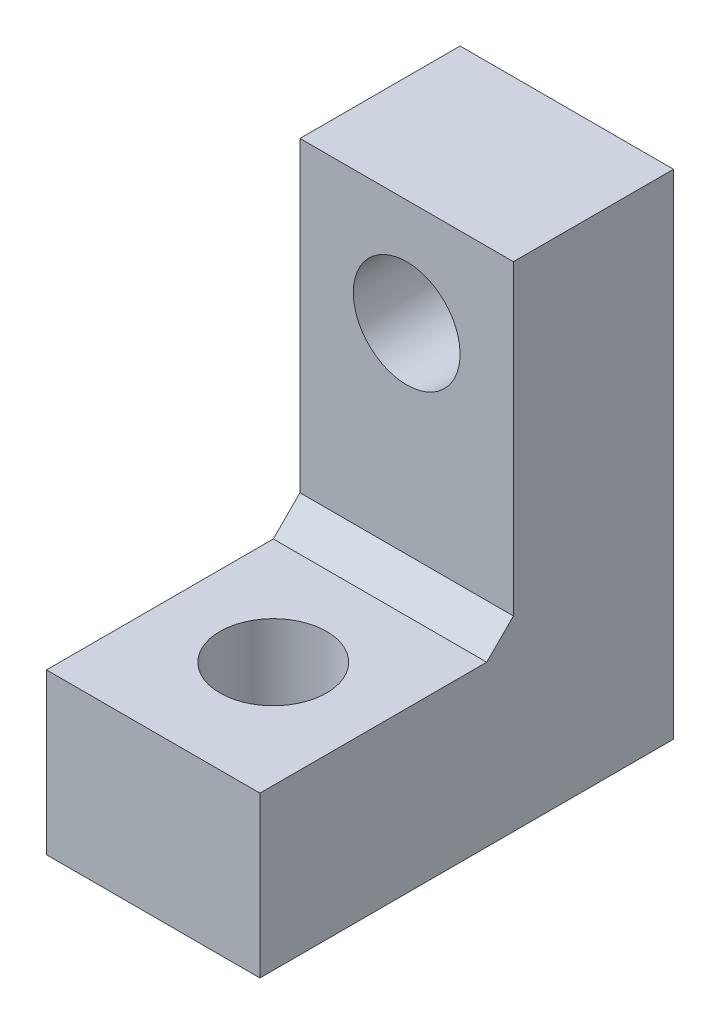
ISO-10303-21;
HEADER;
FILE_DESCRIPTION(('STEP AP214'),'2;1');
FILE_NAME('part.step','',(''),(''),'','','');
FILE_SCHEMA(('AUTOMOTIVE_DESIGN { 1 0 10303 214 1 1 1 1 }'));
ENDSEC;
DATA;
#1=APPLICATION_CONTEXT('core data for automotive mechanical design processes');
#2=APPLICATION_PROTOCOL_DEFINITION('international standard','automotive_design',2000,#1);
#3=PRODUCT_CONTEXT('',#1,'mechanical');
#4=PRODUCT('Part','Part','',(#3));
#5=PRODUCT_RELATED_PRODUCT_CATEGORY('part','',(#4));
#6=PRODUCT_DEFINITION_FORMATION('','',#4);
#7=PRODUCT_DEFINITION_CONTEXT('part definition',#1,'design');
#8=PRODUCT_DEFINITION('design','',#6,#7);
#9=PRODUCT_DEFINITION_SHAPE('','',#8);
#10=(LENGTH_UNIT() NAMED_UNIT(*) SI_UNIT(.MILLI.,.METRE.));
#11=(NAMED_UNIT(*) PLANE_ANGLE_UNIT() SI_UNIT($,.RADIAN.));
#12=(NAMED_UNIT(*) SI_UNIT($,.STERADIAN.) SOLID_ANGLE_UNIT());
#13=UNCERTAINTY_MEASURE_WITH_UNIT(LENGTH_MEASURE(1.E-05),#10,'distance_accuracy_value','');
#14=(GEOMETRIC_REPRESENTATION_CONTEXT(3) GLOBAL_UNCERTAINTY_ASSIGNED_CONTEXT((#13)) GLOBAL_UNIT_ASSIGNED_CONTEXT((#10,
#11,#12)) REPRESENTATION_CONTEXT('',''));
#15=CARTESIAN_POINT('',(0.,0.,0.));
#16=DIRECTION('',(0.,0.,1.));
#17=DIRECTION('',(1.,0.,0.));
#18=AXIS2_PLACEMENT_3D('',#15,#16,#17);
#19=CARTESIAN_POINT('',(8.,0.,-9.5));
#20=DIRECTION('',(0.,0.,1.));
#21=DIRECTION('',(0.,-1.,0.));
#22=AXIS2_PLACEMENT_3D('',#19,#20,#21);
#23=PLANE('',#22);
#24=CARTESIAN_POINT('',(4.,14.5,-9.5));
#25=DIRECTION('',(0.,0.,1.));
#26=DIRECTION('',(0.,-1.,0.));
#27=AXIS2_PLACEMENT_3D('',#24,#25,#26);
#28=CIRCLE('',#27,2.);
#29=CARTESIAN_POINT('',(4.,12.5,-9.5));
#30=VERTEX_POINT('',#29);
#31=EDGE_CURVE('E127',#30,#30,#28,.F.);
#32=ORIENTED_EDGE('',*,*,#31,.T.);
#33=EDGE_LOOP('',(#32));
#34=FACE_BOUND('',#33,.T.);
#35=DIRECTION('',(0.,1.,0.));
#36=VECTOR('',#35,1.);
#37=CARTESIAN_POINT('',(0.,0.,-9.5));
#38=LINE('',#37,#36);
#39=CARTESIAN_POINT('',(0.,7.,-9.5));
#40=VERTEX_POINT('',#39);
#41=CARTESIAN_POINT('',(0.,18.5,-9.5));
#42=VERTEX_POINT('',#41);
#43=EDGE_CURVE('E125',#40,#42,#38,.T.);
#44=ORIENTED_EDGE('',*,*,#43,.F.);
#45=DIRECTION('',(1.,0.,0.));
#46=VECTOR('',#45,1.);
#47=CARTESIAN_POINT('',(8.,7.,-9.5));
#48=LINE('',#47,#46);
#49=CARTESIAN_POINT('',(8.,7.,-9.5));
#50=VERTEX_POINT('',#49);
#51=EDGE_CURVE('E49',#40,#50,#48,.T.);
#52=ORIENTED_EDGE('',*,*,#51,.T.);
#53=DIRECTION('',(0.,1.,0.));
#54=VECTOR('',#53,1.);
#55=CARTESIAN_POINT('',(8.,0.,-9.5));
#56=LINE('',#55,#54);
#57=CARTESIAN_POINT('',(8.,18.5,-9.5));
#58=VERTEX_POINT('',#57);
#59=EDGE_CURVE('E110',#50,#58,#56,.T.);
#60=ORIENTED_EDGE('',*,*,#59,.T.);
#61=DIRECTION('',(-1.,0.,0.));
#62=VECTOR('',#61,1.);
#63=CARTESIAN_POINT('',(8.,18.5,-9.5));
#64=LINE('',#63,#62);
#65=EDGE_CURVE('E124',#58,#42,#64,.T.);
#66=ORIENTED_EDGE('',*,*,#65,.T.);
#67=EDGE_LOOP('',(#44,#52,#60,#66));
#68=FACE_BOUND('',#67,.T.);
#69=ADVANCED_FACE('F34',(#34,#68),#23,.T.);
#70=CARTESIAN_POINT('',(8.,6.,0.));
#71=DIRECTION('',(0.,1.,0.));
#72=DIRECTION('',(0.,0.,1.));
#73=AXIS2_PLACEMENT_3D('',#70,#71,#72);
#74=PLANE('',#73);
#75=CARTESIAN_POINT('',(4.,6.,-4.5));
#76=DIRECTION('',(0.,1.,0.));
#77=DIRECTION('',(0.,0.,1.));
#78=AXIS2_PLACEMENT_3D('',#75,#76,#77);
#79=CIRCLE('',#78,2.);
#80=CARTESIAN_POINT('',(4.,6.,-2.5));
#81=VERTEX_POINT('',#80);
#82=EDGE_CURVE('E177',#81,#81,#79,.T.);
#83=ORIENTED_EDGE('',*,*,#82,.F.);
#84=EDGE_LOOP('',(#83));
#85=FACE_BOUND('',#84,.T.);
#86=DIRECTION('',(0.,0.,-1.));
#87=VECTOR('',#86,1.);
#88=CARTESIAN_POINT('',(8.,6.,0.));
#89=LINE('',#88,#87);
#90=CARTESIAN_POINT('',(8.,6.,0.));
#91=VERTEX_POINT('',#90);
#92=CARTESIAN_POINT('',(8.,6.,-8.49999999999999));
#93=VERTEX_POINT('',#92);
#94=EDGE_CURVE('E95',#91,#93,#89,.T.);
#95=ORIENTED_EDGE('',*,*,#94,.T.);
#96=DIRECTION('',(-1.,0.,0.));
#97=VECTOR('',#96,1.);
#98=CARTESIAN_POINT('',(0.,6.,-8.49999999999999));
#99=LINE('',#98,#97);
#100=CARTESIAN_POINT('',(0.,6.,-8.49999999999999));
#101=VERTEX_POINT('',#100);
#102=EDGE_CURVE('E102',#93,#101,#99,.T.);
#103=ORIENTED_EDGE('',*,*,#102,.T.);
#104=DIRECTION('',(0.,0.,-1.));
#105=VECTOR('',#104,1.);
#106=CARTESIAN_POINT('',(0.,6.,0.));
#107=LINE('',#106,#105);
#108=CARTESIAN_POINT('',(0.,6.,0.));
#109=VERTEX_POINT('',#108);
#110=EDGE_CURVE('E97',#109,#101,#107,.T.);
#111=ORIENTED_EDGE('',*,*,#110,.F.);
#112=DIRECTION('',(-1.,0.,0.));
#113=VECTOR('',#112,1.);
#114=CARTESIAN_POINT('',(8.,6.,0.));
#115=LINE('',#114,#113);
#116=EDGE_CURVE('E91',#91,#109,#115,.T.);
#117=ORIENTED_EDGE('',*,*,#116,.F.);
#118=EDGE_LOOP('',(#95,#103,#111,#117));
#119=FACE_BOUND('',#118,.T.);
#120=ADVANCED_FACE('F93',(#85,#119),#74,.T.);
#121=CARTESIAN_POINT('',(8.,0.,0.));
#122=DIRECTION('',(0.,0.,1.));
#123=DIRECTION('',(1.,0.,0.));
#124=AXIS2_PLACEMENT_3D('',#121,#122,#123);
#125=PLANE('',#124);
#126=DIRECTION('',(0.,1.,0.));
#127=VECTOR('',#126,1.);
#128=CARTESIAN_POINT('',(0.,0.,0.));
#129=LINE('',#128,#127);
#130=CARTESIAN_POINT('',(0.,0.,0.));
#131=VERTEX_POINT('',#130);
#132=EDGE_CURVE('E129',#131,#109,#129,.T.);
#133=ORIENTED_EDGE('',*,*,#132,.F.);
#134=DIRECTION('',(-1.,0.,0.));
#135=VECTOR('',#134,1.);
#136=CARTESIAN_POINT('',(8.,0.,0.));
#137=LINE('',#136,#135);
#138=CARTESIAN_POINT('',(8.,0.,0.));
#139=VERTEX_POINT('',#138);
#140=EDGE_CURVE('E103',#139,#131,#137,.T.);
#141=ORIENTED_EDGE('',*,*,#140,.F.);
#142=DIRECTION('',(0.,1.,0.));
#143=VECTOR('',#142,1.);
#144=CARTESIAN_POINT('',(8.,0.,0.));
#145=LINE('',#144,#143);
#146=EDGE_CURVE('E108',#139,#91,#145,.T.);
#147=ORIENTED_EDGE('',*,*,#146,.T.);
#148=ORIENTED_EDGE('',*,*,#116,.T.);
#149=EDGE_LOOP('',(#133,#141,#147,#148));
#150=FACE_BOUND('',#149,.T.);
#151=ADVANCED_FACE('F112',(#150),#125,.T.);
#152=CARTESIAN_POINT('',(8.,0.,0.));
#153=DIRECTION('',(0.,1.,0.));
#154=DIRECTION('',(0.,0.,1.));
#155=AXIS2_PLACEMENT_3D('',#152,#153,#154);
#156=PLANE('',#155);
#157=CARTESIAN_POINT('',(4.,0.,-4.5));
#158=DIRECTION('',(0.,1.,0.));
#159=DIRECTION('',(0.,0.,1.));
#160=AXIS2_PLACEMENT_3D('',#157,#158,#159);
#161=CIRCLE('',#160,2.);
#162=CARTESIAN_POINT('',(4.,0.,-2.5));
#163=VERTEX_POINT('',#162);
#164=EDGE_CURVE('E172',#163,#163,#161,.T.);
#165=ORIENTED_EDGE('',*,*,#164,.T.);
#166=EDGE_LOOP('',(#165));
#167=FACE_BOUND('',#166,.T.);
#168=DIRECTION('',(0.,0.,-1.));
#169=VECTOR('',#168,1.);
#170=CARTESIAN_POINT('',(0.,0.,0.));
#171=LINE('',#170,#169);
#172=CARTESIAN_POINT('',(0.,0.,-15.5));
#173=VERTEX_POINT('',#172);
#174=EDGE_CURVE('E131',#131,#173,#171,.T.);
#175=ORIENTED_EDGE('',*,*,#174,.T.);
#176=DIRECTION('',(-1.,0.,0.));
#177=VECTOR('',#176,1.);
#178=CARTESIAN_POINT('',(8.,0.,-15.5));
#179=LINE('',#178,#177);
#180=CARTESIAN_POINT('',(8.,0.,-15.5));
#181=VERTEX_POINT('',#180);
#182=EDGE_CURVE('E143',#181,#173,#179,.T.);
#183=ORIENTED_EDGE('',*,*,#182,.F.);
#184=DIRECTION('',(0.,0.,-1.));
#185=VECTOR('',#184,1.);
#186=CARTESIAN_POINT('',(8.,0.,0.));
#187=LINE('',#186,#185);
#188=EDGE_CURVE('E114',#139,#181,#187,.T.);
#189=ORIENTED_EDGE('',*,*,#188,.F.);
#190=ORIENTED_EDGE('',*,*,#140,.T.);
#191=EDGE_LOOP('',(#175,#183,#189,#190));
#192=FACE_BOUND('',#191,.T.);
#193=ADVANCED_FACE('F155',(#167,#192),#156,.F.);
#194=CARTESIAN_POINT('',(8.,0.,-15.5));
#195=DIRECTION('',(0.,0.,1.));
#196=DIRECTION('',(1.,0.,0.));
#197=AXIS2_PLACEMENT_3D('',#194,#195,#196);
#198=PLANE('',#197);
#199=CARTESIAN_POINT('',(4.,14.5,-15.5));
#200=DIRECTION('',(0.,0.,-1.));
#201=DIRECTION('',(-1.,0.,0.));
#202=AXIS2_PLACEMENT_3D('',#199,#200,#201);
#203=CIRCLE('',#202,2.);
#204=CARTESIAN_POINT('',(2.,14.5,-15.5));
#205=VERTEX_POINT('',#204);
#206=EDGE_CURVE('E168',#205,#205,#203,.T.);
#207=ORIENTED_EDGE('',*,*,#206,.F.);
#208=EDGE_LOOP('',(#207));
#209=FACE_BOUND('',#208,.T.);
#210=CARTESIAN_POINT('',(4.,4.5,-15.5));
#211=DIRECTION('',(0.,0.,-1.));
#212=DIRECTION('',(-1.,0.,0.));
#213=AXIS2_PLACEMENT_3D('',#210,#211,#212);
#214=CIRCLE('',#213,2.);
#215=CARTESIAN_POINT('',(2.,4.5,-15.5));
#216=VERTEX_POINT('',#215);
#217=EDGE_CURVE('E169',#216,#216,#214,.T.);
#218=ORIENTED_EDGE('',*,*,#217,.F.);
#219=EDGE_LOOP('',(#218));
#220=FACE_BOUND('',#219,.T.);
#221=DIRECTION('',(0.,1.,0.));
#222=VECTOR('',#221,1.);
#223=CARTESIAN_POINT('',(0.,0.,-15.5));
#224=LINE('',#223,#222);
#225=CARTESIAN_POINT('',(0.,18.5,-15.5));
#226=VERTEX_POINT('',#225);
#227=EDGE_CURVE('E133',#173,#226,#224,.T.);
#228=ORIENTED_EDGE('',*,*,#227,.T.);
#229=DIRECTION('',(-1.,0.,0.));
#230=VECTOR('',#229,1.);
#231=CARTESIAN_POINT('',(8.,18.5,-15.5));
#232=LINE('',#231,#230);
#233=CARTESIAN_POINT('',(8.,18.5,-15.5));
#234=VERTEX_POINT('',#233);
#235=EDGE_CURVE('E140',#234,#226,#232,.T.);
#236=ORIENTED_EDGE('',*,*,#235,.F.);
#237=DIRECTION('',(0.,1.,0.));
#238=VECTOR('',#237,1.);
#239=CARTESIAN_POINT('',(8.,0.,-15.5));
#240=LINE('',#239,#238);
#241=EDGE_CURVE('E116',#181,#234,#240,.T.);
#242=ORIENTED_EDGE('',*,*,#241,.F.);
#243=ORIENTED_EDGE('',*,*,#182,.T.);
#244=EDGE_LOOP('',(#228,#236,#242,#243));
#245=FACE_BOUND('',#244,.T.);
#246=ADVANCED_FACE('F158',(#209,#220,#245),#198,.F.);
#247=CARTESIAN_POINT('',(8.,18.5,0.));
#248=DIRECTION('',(0.,-1.,0.));
#249=DIRECTION('',(0.,0.,-1.));
#250=AXIS2_PLACEMENT_3D('',#247,#248,#249);
#251=PLANE('',#250);
#252=DIRECTION('',(0.,0.,1.));
#253=VECTOR('',#252,1.);
#254=CARTESIAN_POINT('',(0.,18.5,0.));
#255=LINE('',#254,#253);
#256=EDGE_CURVE('E135',#226,#42,#255,.T.);
#257=ORIENTED_EDGE('',*,*,#256,.T.);
#258=ORIENTED_EDGE('',*,*,#65,.F.);
#259=DIRECTION('',(0.,0.,1.));
#260=VECTOR('',#259,1.);
#261=CARTESIAN_POINT('',(8.,18.5,0.));
#262=LINE('',#261,#260);
#263=EDGE_CURVE('E121',#234,#58,#262,.T.);
#264=ORIENTED_EDGE('',*,*,#263,.F.);
#265=ORIENTED_EDGE('',*,*,#235,.T.);
#266=EDGE_LOOP('',(#257,#258,#264,#265));
#267=FACE_BOUND('',#266,.T.);
#268=ADVANCED_FACE('F163',(#267),#251,.F.);
#269=CARTESIAN_POINT('',(8.,0.,0.));
#270=DIRECTION('',(1.,0.,0.));
#271=DIRECTION('',(0.,0.,-1.));
#272=AXIS2_PLACEMENT_3D('',#269,#270,#271);
#273=PLANE('',#272);
#274=ORIENTED_EDGE('',*,*,#59,.F.);
#275=DIRECTION('',(0.,0.707106781186544,-0.707106781186551));
#276=VECTOR('',#275,1.);
#277=CARTESIAN_POINT('',(8.,6.,-8.49999999999999));
#278=LINE('',#277,#276);
#279=EDGE_CURVE('E11',#50,#93,#278,.F.);
#280=ORIENTED_EDGE('',*,*,#279,.T.);
#281=ORIENTED_EDGE('',*,*,#94,.F.);
#282=ORIENTED_EDGE('',*,*,#146,.F.);
#283=ORIENTED_EDGE('',*,*,#188,.T.);
#284=ORIENTED_EDGE('',*,*,#241,.T.);
#285=ORIENTED_EDGE('',*,*,#263,.T.);
#286=EDGE_LOOP('',(#274,#280,#281,#282,#283,#284,#285));
#287=FACE_BOUND('',#286,.T.);
#288=ADVANCED_FACE('F107',(#287),#273,.T.);
#289=CARTESIAN_POINT('',(0.,0.,0.));
#290=DIRECTION('',(1.,0.,0.));
#291=DIRECTION('',(0.,0.,-1.));
#292=AXIS2_PLACEMENT_3D('',#289,#290,#291);
#293=PLANE('',#292);
#294=ORIENTED_EDGE('',*,*,#110,.T.);
#295=DIRECTION('',(0.,-0.707106781186544,0.707106781186551));
#296=VECTOR('',#295,1.);
#297=CARTESIAN_POINT('',(0.,-1.24999999999997,-1.24999999999996));
#298=LINE('',#297,#296);
#299=EDGE_CURVE('E42',#101,#40,#298,.F.);
#300=ORIENTED_EDGE('',*,*,#299,.T.);
#301=ORIENTED_EDGE('',*,*,#43,.T.);
#302=ORIENTED_EDGE('',*,*,#256,.F.);
#303=ORIENTED_EDGE('',*,*,#227,.F.);
#304=ORIENTED_EDGE('',*,*,#174,.F.);
#305=ORIENTED_EDGE('',*,*,#132,.T.);
#306=EDGE_LOOP('',(#294,#300,#301,#302,#303,#304,#305));
#307=FACE_BOUND('',#306,.T.);
#308=ADVANCED_FACE('F149',(#307),#293,.F.);
#309=CARTESIAN_POINT('',(8.,6.,-8.49999999999999));
#310=DIRECTION('',(0.,0.70710678118655,0.707106781186544));
#311=DIRECTION('',(1.,0.,0.));
#312=AXIS2_PLACEMENT_3D('',#309,#310,#311);
#313=PLANE('',#312);
#314=ORIENTED_EDGE('',*,*,#279,.F.);
#315=ORIENTED_EDGE('',*,*,#51,.F.);
#316=ORIENTED_EDGE('',*,*,#299,.F.);
#317=ORIENTED_EDGE('',*,*,#102,.F.);
#318=EDGE_LOOP('',(#314,#315,#316,#317));
#319=FACE_BOUND('',#318,.T.);
#320=ADVANCED_FACE('F36',(#319),#313,.T.);
#321=CARTESIAN_POINT('',(8.,0.,-9.5));
#322=DIRECTION('',(0.,0.,1.));
#323=DIRECTION('',(0.,-1.,0.));
#324=AXIS2_PLACEMENT_3D('',#321,#322,#323);
#325=PLANE('',#324);
#326=CARTESIAN_POINT('',(4.,4.5,-9.5));
#327=DIRECTION('',(0.,0.,1.));
#328=DIRECTION('',(0.,-1.,0.));
#329=AXIS2_PLACEMENT_3D('',#326,#327,#328);
#330=CIRCLE('',#329,2.);
#331=CARTESIAN_POINT('',(4.,2.5,-9.5));
#332=VERTEX_POINT('',#331);
#333=EDGE_CURVE('E165',#332,#332,#330,.F.);
#334=ORIENTED_EDGE('',*,*,#333,.T.);
#335=EDGE_LOOP('',(#334));
#336=FACE_BOUND('',#335,.T.);
#337=ADVANCED_FACE('F211',(#336),#325,.F.);
#338=CARTESIAN_POINT('',(4.,4.5,-3.84314575050762));
#339=DIRECTION('',(0.,0.,-1.));
#340=DIRECTION('',(-1.,0.,0.));
#341=AXIS2_PLACEMENT_3D('',#338,#339,#340);
#342=CYLINDRICAL_SURFACE('',#341,2.);
#343=ORIENTED_EDGE('',*,*,#217,.T.);
#344=EDGE_LOOP('',(#343));
#345=FACE_BOUND('',#344,.T.);
#346=ORIENTED_EDGE('',*,*,#333,.F.);
#347=EDGE_LOOP('',(#346));
#348=FACE_BOUND('',#347,.T.);
#349=ADVANCED_FACE('F214',(#345,#348),#342,.F.);
#350=CARTESIAN_POINT('',(4.,14.5,-3.84314575050762));
#351=DIRECTION('',(0.,0.,-1.));
#352=DIRECTION('',(-1.,0.,0.));
#353=AXIS2_PLACEMENT_3D('',#350,#351,#352);
#354=CYLINDRICAL_SURFACE('',#353,2.);
#355=ORIENTED_EDGE('',*,*,#206,.T.);
#356=EDGE_LOOP('',(#355));
#357=FACE_BOUND('',#356,.T.);
#358=ORIENTED_EDGE('',*,*,#31,.F.);
#359=EDGE_LOOP('',(#358));
#360=FACE_BOUND('',#359,.T.);
#361=ADVANCED_FACE('F187',(#357,#360),#354,.F.);
#362=CARTESIAN_POINT('',(4.,0.,-4.5));
#363=DIRECTION('',(0.,1.,0.));
#364=DIRECTION('',(0.,0.,1.));
#365=AXIS2_PLACEMENT_3D('',#362,#363,#364);
#366=CYLINDRICAL_SURFACE('',#365,2.);
#367=ORIENTED_EDGE('',*,*,#164,.F.);
#368=EDGE_LOOP('',(#367));
#369=FACE_BOUND('',#368,.T.);
#370=ORIENTED_EDGE('',*,*,#82,.T.);
#371=EDGE_LOOP('',(#370));
#372=FACE_BOUND('',#371,.T.);
#373=ADVANCED_FACE('F184',(#369,#372),#366,.F.);
#374=CLOSED_SHELL('',(#69,#120,#151,#193,#246,#268,#288,#308,#320,#337,#349,#361,#373));
#375=MANIFOLD_SOLID_BREP('B2',#374);
#376=ADVANCED_BREP_SHAPE_REPRESENTATION('',(#18,#375),#14);
#377=SHAPE_DEFINITION_REPRESENTATION(#9,#376);
ENDSEC;
END-ISO-10303-21;
